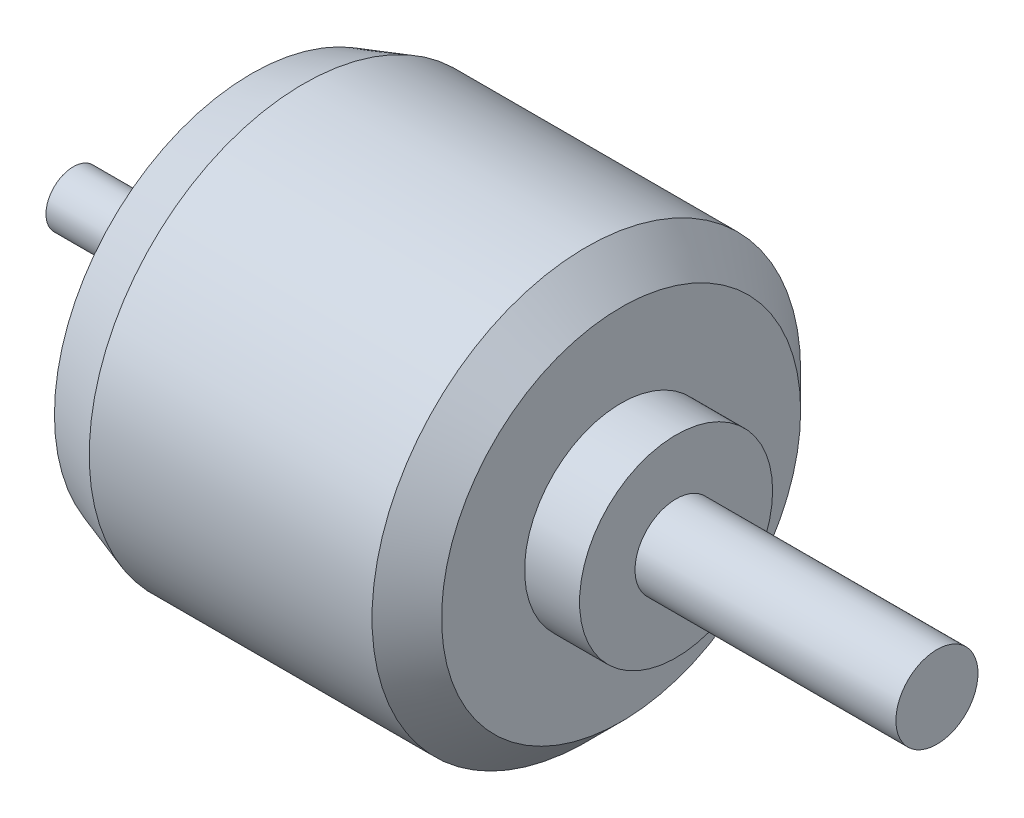
ISO-10303-21;
HEADER;
FILE_DESCRIPTION(('STEP AP214'),'2;1');
FILE_NAME('part.step','',(''),(''),'','','');
FILE_SCHEMA(('AUTOMOTIVE_DESIGN { 1 0 10303 214 1 1 1 1 }'));
ENDSEC;
DATA;
#1=APPLICATION_CONTEXT('core data for automotive mechanical design processes');
#2=APPLICATION_PROTOCOL_DEFINITION('international standard','automotive_design',2000,#1);
#3=PRODUCT_CONTEXT('',#1,'mechanical');
#4=PRODUCT('Part','Part','',(#3));
#5=PRODUCT_RELATED_PRODUCT_CATEGORY('part','',(#4));
#6=PRODUCT_DEFINITION_FORMATION('','',#4);
#7=PRODUCT_DEFINITION_CONTEXT('part definition',#1,'design');
#8=PRODUCT_DEFINITION('design','',#6,#7);
#9=PRODUCT_DEFINITION_SHAPE('','',#8);
#10=(LENGTH_UNIT() NAMED_UNIT(*) SI_UNIT(.MILLI.,.METRE.));
#11=(NAMED_UNIT(*) PLANE_ANGLE_UNIT() SI_UNIT($,.RADIAN.));
#12=(NAMED_UNIT(*) SI_UNIT($,.STERADIAN.) SOLID_ANGLE_UNIT());
#13=UNCERTAINTY_MEASURE_WITH_UNIT(LENGTH_MEASURE(1.E-05),#10,'distance_accuracy_value','');
#14=(GEOMETRIC_REPRESENTATION_CONTEXT(3) GLOBAL_UNCERTAINTY_ASSIGNED_CONTEXT((#13)) GLOBAL_UNIT_ASSIGNED_CONTEXT((#10,
#11,#12)) REPRESENTATION_CONTEXT('',''));
#15=CARTESIAN_POINT('',(0.,0.,0.));
#16=DIRECTION('',(0.,0.,1.));
#17=DIRECTION('',(1.,0.,0.));
#18=AXIS2_PLACEMENT_3D('',#15,#16,#17);
#19=CARTESIAN_POINT('',(26.,0.,0.));
#20=DIRECTION('',(-1.,0.,0.));
#21=DIRECTION('',(0.,0.,1.));
#22=AXIS2_PLACEMENT_3D('',#19,#20,#21);
#23=CYLINDRICAL_SURFACE('',#22,4.);
#24=CARTESIAN_POINT('',(26.,0.,0.));
#25=DIRECTION('',(1.,0.,0.));
#26=DIRECTION('',(0.,0.,-1.));
#27=AXIS2_PLACEMENT_3D('',#24,#25,#26);
#28=CIRCLE('',#27,4.);
#29=CARTESIAN_POINT('',(26.,0.,-4.));
#30=VERTEX_POINT('',#29);
#31=EDGE_CURVE('E111',#30,#30,#28,.T.);
#32=ORIENTED_EDGE('',*,*,#31,.F.);
#33=EDGE_LOOP('',(#32));
#34=FACE_BOUND('',#33,.T.);
#35=CARTESIAN_POINT('',(0.,0.,0.));
#36=DIRECTION('',(1.,0.,0.));
#37=DIRECTION('',(0.,0.,-1.));
#38=AXIS2_PLACEMENT_3D('',#35,#36,#37);
#39=CIRCLE('',#38,4.);
#40=CARTESIAN_POINT('',(0.,0.,-4.));
#41=VERTEX_POINT('',#40);
#42=EDGE_CURVE('E66',#41,#41,#39,.T.);
#43=ORIENTED_EDGE('',*,*,#42,.T.);
#44=EDGE_LOOP('',(#43));
#45=FACE_BOUND('',#44,.T.);
#46=ADVANCED_FACE('F41',(#34,#45),#23,.T.);
#47=CARTESIAN_POINT('',(0.,0.,0.));
#48=DIRECTION('',(1.,0.,0.));
#49=DIRECTION('',(0.,0.,-1.));
#50=AXIS2_PLACEMENT_3D('',#47,#48,#49);
#51=PLANE('',#50);
#52=ORIENTED_EDGE('',*,*,#42,.F.);
#53=EDGE_LOOP('',(#52));
#54=FACE_BOUND('',#53,.T.);
#55=ADVANCED_FACE('F145',(#54),#51,.F.);
#56=CARTESIAN_POINT('',(80.,0.,0.));
#57=DIRECTION('',(-1.,0.,0.));
#58=DIRECTION('',(0.,0.,1.));
#59=AXIS2_PLACEMENT_3D('',#56,#57,#58);
#60=CYLINDRICAL_SURFACE('',#59,31.3);
#61=CARTESIAN_POINT('',(74.9199999999999,0.,0.));
#62=DIRECTION('',(1.,0.,0.));
#63=DIRECTION('',(0.,0.,-1.));
#64=AXIS2_PLACEMENT_3D('',#61,#62,#63);
#65=CIRCLE('',#64,31.3);
#66=CARTESIAN_POINT('',(74.9199999999999,0.,-31.3));
#67=VERTEX_POINT('',#66);
#68=EDGE_CURVE('E46',#67,#67,#65,.F.);
#69=ORIENTED_EDGE('',*,*,#68,.T.);
#70=EDGE_LOOP('',(#69));
#71=FACE_BOUND('',#70,.T.);
#72=CARTESIAN_POINT('',(33.62,0.,0.));
#73=DIRECTION('',(1.,0.,0.));
#74=DIRECTION('',(0.,0.,-1.));
#75=AXIS2_PLACEMENT_3D('',#72,#73,#74);
#76=CIRCLE('',#75,31.3);
#77=CARTESIAN_POINT('',(33.62,0.,-31.3));
#78=VERTEX_POINT('',#77);
#79=EDGE_CURVE('E114',#78,#78,#76,.T.);
#80=ORIENTED_EDGE('',*,*,#79,.T.);
#81=EDGE_LOOP('',(#80));
#82=FACE_BOUND('',#81,.T.);
#83=ADVANCED_FACE('F128',(#71,#82),#60,.T.);
#84=CARTESIAN_POINT('',(80.,0.,0.));
#85=DIRECTION('',(1.,0.,0.));
#86=DIRECTION('',(0.,0.,-1.));
#87=AXIS2_PLACEMENT_3D('',#84,#85,#86);
#88=PLANE('',#87);
#89=CARTESIAN_POINT('',(80.,0.,0.));
#90=DIRECTION('',(1.,0.,0.));
#91=DIRECTION('',(0.,0.,-1.));
#92=AXIS2_PLACEMENT_3D('',#89,#90,#91);
#93=CIRCLE('',#92,14.097);
#94=CARTESIAN_POINT('',(80.,0.,-14.097));
#95=VERTEX_POINT('',#94);
#96=EDGE_CURVE('E50',#95,#95,#93,.T.);
#97=ORIENTED_EDGE('',*,*,#96,.F.);
#98=EDGE_LOOP('',(#97));
#99=FACE_BOUND('',#98,.T.);
#100=CARTESIAN_POINT('',(80.,0.,0.));
#101=DIRECTION('',(1.,0.,0.));
#102=DIRECTION('',(0.,0.,-1.));
#103=AXIS2_PLACEMENT_3D('',#100,#101,#102);
#104=CIRCLE('',#103,26.22);
#105=CARTESIAN_POINT('',(80.,0.,-26.22));
#106=VERTEX_POINT('',#105);
#107=EDGE_CURVE('E121',#106,#106,#104,.T.);
#108=ORIENTED_EDGE('',*,*,#107,.T.);
#109=EDGE_LOOP('',(#108));
#110=FACE_BOUND('',#109,.T.);
#111=ADVANCED_FACE('F163',(#99,#110),#88,.T.);
#112=CARTESIAN_POINT('',(26.,0.,0.));
#113=DIRECTION('',(1.,0.,0.));
#114=DIRECTION('',(0.,0.,-1.));
#115=AXIS2_PLACEMENT_3D('',#112,#113,#114);
#116=PLANE('',#115);
#117=CARTESIAN_POINT('',(26.,0.,0.));
#118=DIRECTION('',(1.,0.,0.));
#119=DIRECTION('',(0.,0.,-1.));
#120=AXIS2_PLACEMENT_3D('',#117,#118,#119);
#121=CIRCLE('',#120,28.76);
#122=CARTESIAN_POINT('',(26.,0.,-28.76));
#123=VERTEX_POINT('',#122);
#124=EDGE_CURVE('E119',#123,#123,#121,.F.);
#125=ORIENTED_EDGE('',*,*,#124,.T.);
#126=EDGE_LOOP('',(#125));
#127=FACE_BOUND('',#126,.T.);
#128=CARTESIAN_POINT('',(26.,22.,0.));
#129=DIRECTION('',(-1.,0.,0.));
#130=DIRECTION('',(0.,0.,1.));
#131=AXIS2_PLACEMENT_3D('',#128,#129,#130);
#132=CIRCLE('',#131,2.);
#133=CARTESIAN_POINT('',(26.,22.,2.));
#134=VERTEX_POINT('',#133);
#135=EDGE_CURVE('E67',#134,#134,#132,.T.);
#136=ORIENTED_EDGE('',*,*,#135,.F.);
#137=EDGE_LOOP('',(#136));
#138=FACE_BOUND('',#137,.T.);
#139=CARTESIAN_POINT('',(26.,0.,-15.));
#140=DIRECTION('',(-1.,0.,0.));
#141=DIRECTION('',(0.,0.,1.));
#142=AXIS2_PLACEMENT_3D('',#139,#140,#141);
#143=CIRCLE('',#142,2.);
#144=CARTESIAN_POINT('',(26.,0.,-13.));
#145=VERTEX_POINT('',#144);
#146=EDGE_CURVE('E84',#145,#145,#143,.T.);
#147=ORIENTED_EDGE('',*,*,#146,.F.);
#148=EDGE_LOOP('',(#147));
#149=FACE_BOUND('',#148,.T.);
#150=CARTESIAN_POINT('',(26.,0.,22.));
#151=DIRECTION('',(-1.,0.,0.));
#152=DIRECTION('',(0.,0.,1.));
#153=AXIS2_PLACEMENT_3D('',#150,#151,#152);
#154=CIRCLE('',#153,2.);
#155=CARTESIAN_POINT('',(26.,0.,24.));
#156=VERTEX_POINT('',#155);
#157=EDGE_CURVE('E78',#156,#156,#154,.T.);
#158=ORIENTED_EDGE('',*,*,#157,.F.);
#159=EDGE_LOOP('',(#158));
#160=FACE_BOUND('',#159,.T.);
#161=CARTESIAN_POINT('',(26.,-15.,-1.57116660247941E-13));
#162=DIRECTION('',(-1.,0.,0.));
#163=DIRECTION('',(0.,0.,1.));
#164=AXIS2_PLACEMENT_3D('',#161,#162,#163);
#165=CIRCLE('',#164,2.);
#166=CARTESIAN_POINT('',(26.,-15.,1.99999999999984));
#167=VERTEX_POINT('',#166);
#168=EDGE_CURVE('E71',#167,#167,#165,.T.);
#169=ORIENTED_EDGE('',*,*,#168,.F.);
#170=EDGE_LOOP('',(#169));
#171=FACE_BOUND('',#170,.T.);
#172=CARTESIAN_POINT('',(26.,0.,15.));
#173=DIRECTION('',(-1.,0.,0.));
#174=DIRECTION('',(0.,0.,1.));
#175=AXIS2_PLACEMENT_3D('',#172,#173,#174);
#176=CIRCLE('',#175,2.);
#177=CARTESIAN_POINT('',(26.,0.,17.));
#178=VERTEX_POINT('',#177);
#179=EDGE_CURVE('E70',#178,#178,#176,.T.);
#180=ORIENTED_EDGE('',*,*,#179,.F.);
#181=EDGE_LOOP('',(#180));
#182=FACE_BOUND('',#181,.T.);
#183=CARTESIAN_POINT('',(26.,-22.,0.));
#184=DIRECTION('',(-1.,0.,0.));
#185=DIRECTION('',(0.,0.,1.));
#186=AXIS2_PLACEMENT_3D('',#183,#184,#185);
#187=CIRCLE('',#186,2.);
#188=CARTESIAN_POINT('',(26.,-22.,2.00000000000001));
#189=VERTEX_POINT('',#188);
#190=EDGE_CURVE('E106',#189,#189,#187,.T.);
#191=ORIENTED_EDGE('',*,*,#190,.F.);
#192=EDGE_LOOP('',(#191));
#193=FACE_BOUND('',#192,.T.);
#194=CARTESIAN_POINT('',(26.,-3.19374361129754E-13,-21.9999999999997));
#195=DIRECTION('',(-1.,0.,0.));
#196=DIRECTION('',(0.,0.,1.));
#197=AXIS2_PLACEMENT_3D('',#194,#195,#196);
#198=CIRCLE('',#197,2.00000000000061);
#199=CARTESIAN_POINT('',(26.,-3.19374361129754E-13,-19.9999999999991));
#200=VERTEX_POINT('',#199);
#201=EDGE_CURVE('E89',#200,#200,#198,.T.);
#202=ORIENTED_EDGE('',*,*,#201,.F.);
#203=EDGE_LOOP('',(#202));
#204=FACE_BOUND('',#203,.T.);
#205=CARTESIAN_POINT('',(26.,15.,0.));
#206=DIRECTION('',(-1.,0.,0.));
#207=DIRECTION('',(0.,0.,1.));
#208=AXIS2_PLACEMENT_3D('',#205,#206,#207);
#209=CIRCLE('',#208,2.);
#210=CARTESIAN_POINT('',(26.,15.,2.00000000000005));
#211=VERTEX_POINT('',#210);
#212=EDGE_CURVE('E96',#211,#211,#209,.T.);
#213=ORIENTED_EDGE('',*,*,#212,.F.);
#214=EDGE_LOOP('',(#213));
#215=FACE_BOUND('',#214,.T.);
#216=ORIENTED_EDGE('',*,*,#31,.T.);
#217=EDGE_LOOP('',(#216));
#218=FACE_BOUND('',#217,.T.);
#219=ADVANCED_FACE('F164',(#127,#138,#149,#160,#171,#182,#193,#204,#215,#218),#116,.F.);
#220=CARTESIAN_POINT('',(34.,15.,0.));
#221=DIRECTION('',(-1.,0.,0.));
#222=DIRECTION('',(0.,0.,1.));
#223=AXIS2_PLACEMENT_3D('',#220,#221,#222);
#224=CYLINDRICAL_SURFACE('',#223,2.);
#225=CARTESIAN_POINT('',(34.,15.,0.));
#226=DIRECTION('',(-1.,0.,0.));
#227=DIRECTION('',(0.,0.,1.));
#228=AXIS2_PLACEMENT_3D('',#225,#226,#227);
#229=CIRCLE('',#228,2.);
#230=CARTESIAN_POINT('',(34.,15.,2.00000000000005));
#231=VERTEX_POINT('',#230);
#232=EDGE_CURVE('E74',#231,#231,#229,.T.);
#233=ORIENTED_EDGE('',*,*,#232,.F.);
#234=EDGE_LOOP('',(#233));
#235=FACE_BOUND('',#234,.T.);
#236=ORIENTED_EDGE('',*,*,#212,.T.);
#237=EDGE_LOOP('',(#236));
#238=FACE_BOUND('',#237,.T.);
#239=ADVANCED_FACE('F167',(#235,#238),#224,.F.);
#240=CARTESIAN_POINT('',(34.,0.,0.));
#241=DIRECTION('',(-1.,0.,0.));
#242=DIRECTION('',(0.,0.,1.));
#243=AXIS2_PLACEMENT_3D('',#240,#241,#242);
#244=PLANE('',#243);
#245=ORIENTED_EDGE('',*,*,#232,.T.);
#246=EDGE_LOOP('',(#245));
#247=FACE_BOUND('',#246,.T.);
#248=ADVANCED_FACE('F190',(#247),#244,.T.);
#249=CARTESIAN_POINT('',(34.,-3.19374361129754E-13,-21.9999999999997));
#250=DIRECTION('',(-1.,0.,0.));
#251=DIRECTION('',(0.,0.,1.));
#252=AXIS2_PLACEMENT_3D('',#249,#250,#251);
#253=CYLINDRICAL_SURFACE('',#252,2.00000000000061);
#254=CARTESIAN_POINT('',(34.,-3.19374361129754E-13,-21.9999999999997));
#255=DIRECTION('',(-1.,0.,0.));
#256=DIRECTION('',(0.,0.,1.));
#257=AXIS2_PLACEMENT_3D('',#254,#255,#256);
#258=CIRCLE('',#257,2.00000000000061);
#259=CARTESIAN_POINT('',(34.,-3.19374361129754E-13,-19.9999999999991));
#260=VERTEX_POINT('',#259);
#261=EDGE_CURVE('E93',#260,#260,#258,.T.);
#262=ORIENTED_EDGE('',*,*,#261,.F.);
#263=EDGE_LOOP('',(#262));
#264=FACE_BOUND('',#263,.T.);
#265=ORIENTED_EDGE('',*,*,#201,.T.);
#266=EDGE_LOOP('',(#265));
#267=FACE_BOUND('',#266,.T.);
#268=ADVANCED_FACE('F193',(#264,#267),#253,.F.);
#269=CARTESIAN_POINT('',(34.,0.,0.));
#270=DIRECTION('',(-1.,0.,0.));
#271=DIRECTION('',(0.,0.,1.));
#272=AXIS2_PLACEMENT_3D('',#269,#270,#271);
#273=PLANE('',#272);
#274=ORIENTED_EDGE('',*,*,#261,.T.);
#275=EDGE_LOOP('',(#274));
#276=FACE_BOUND('',#275,.T.);
#277=ADVANCED_FACE('F180',(#276),#273,.T.);
#278=CARTESIAN_POINT('',(34.,-22.,0.));
#279=DIRECTION('',(-1.,0.,0.));
#280=DIRECTION('',(0.,0.,1.));
#281=AXIS2_PLACEMENT_3D('',#278,#279,#280);
#282=CYLINDRICAL_SURFACE('',#281,2.);
#283=CARTESIAN_POINT('',(34.,-22.,0.));
#284=DIRECTION('',(-1.,0.,0.));
#285=DIRECTION('',(0.,0.,1.));
#286=AXIS2_PLACEMENT_3D('',#283,#284,#285);
#287=CIRCLE('',#286,2.);
#288=CARTESIAN_POINT('',(34.,-22.,2.00000000000001));
#289=VERTEX_POINT('',#288);
#290=EDGE_CURVE('E92',#289,#289,#287,.T.);
#291=ORIENTED_EDGE('',*,*,#290,.F.);
#292=EDGE_LOOP('',(#291));
#293=FACE_BOUND('',#292,.T.);
#294=ORIENTED_EDGE('',*,*,#190,.T.);
#295=EDGE_LOOP('',(#294));
#296=FACE_BOUND('',#295,.T.);
#297=ADVANCED_FACE('F176',(#293,#296),#282,.F.);
#298=CARTESIAN_POINT('',(34.,0.,0.));
#299=DIRECTION('',(-1.,0.,0.));
#300=DIRECTION('',(0.,0.,1.));
#301=AXIS2_PLACEMENT_3D('',#298,#299,#300);
#302=PLANE('',#301);
#303=ORIENTED_EDGE('',*,*,#290,.T.);
#304=EDGE_LOOP('',(#303));
#305=FACE_BOUND('',#304,.T.);
#306=ADVANCED_FACE('F172',(#305),#302,.T.);
#307=CARTESIAN_POINT('',(34.,0.,15.));
#308=DIRECTION('',(-1.,0.,0.));
#309=DIRECTION('',(0.,0.,1.));
#310=AXIS2_PLACEMENT_3D('',#307,#308,#309);
#311=CYLINDRICAL_SURFACE('',#310,2.);
#312=CARTESIAN_POINT('',(34.,0.,15.));
#313=DIRECTION('',(-1.,0.,0.));
#314=DIRECTION('',(0.,0.,1.));
#315=AXIS2_PLACEMENT_3D('',#312,#313,#314);
#316=CIRCLE('',#315,2.);
#317=CARTESIAN_POINT('',(34.,0.,17.));
#318=VERTEX_POINT('',#317);
#319=EDGE_CURVE('E103',#318,#318,#316,.T.);
#320=ORIENTED_EDGE('',*,*,#319,.F.);
#321=EDGE_LOOP('',(#320));
#322=FACE_BOUND('',#321,.T.);
#323=ORIENTED_EDGE('',*,*,#179,.T.);
#324=EDGE_LOOP('',(#323));
#325=FACE_BOUND('',#324,.T.);
#326=ADVANCED_FACE('F175',(#322,#325),#311,.F.);
#327=CARTESIAN_POINT('',(34.,0.,0.));
#328=DIRECTION('',(-1.,0.,0.));
#329=DIRECTION('',(0.,0.,1.));
#330=AXIS2_PLACEMENT_3D('',#327,#328,#329);
#331=PLANE('',#330);
#332=ORIENTED_EDGE('',*,*,#319,.T.);
#333=EDGE_LOOP('',(#332));
#334=FACE_BOUND('',#333,.T.);
#335=ADVANCED_FACE('F182',(#334),#331,.T.);
#336=CARTESIAN_POINT('',(34.,-15.,-1.57116660247941E-13));
#337=DIRECTION('',(-1.,0.,0.));
#338=DIRECTION('',(0.,0.,1.));
#339=AXIS2_PLACEMENT_3D('',#336,#337,#338);
#340=CYLINDRICAL_SURFACE('',#339,2.);
#341=CARTESIAN_POINT('',(34.,-15.,-1.57116660247941E-13));
#342=DIRECTION('',(-1.,0.,0.));
#343=DIRECTION('',(0.,0.,1.));
#344=AXIS2_PLACEMENT_3D('',#341,#342,#343);
#345=CIRCLE('',#344,2.);
#346=CARTESIAN_POINT('',(34.,-15.,1.99999999999984));
#347=VERTEX_POINT('',#346);
#348=EDGE_CURVE('E75',#347,#347,#345,.T.);
#349=ORIENTED_EDGE('',*,*,#348,.F.);
#350=EDGE_LOOP('',(#349));
#351=FACE_BOUND('',#350,.T.);
#352=ORIENTED_EDGE('',*,*,#168,.T.);
#353=EDGE_LOOP('',(#352));
#354=FACE_BOUND('',#353,.T.);
#355=ADVANCED_FACE('F185',(#351,#354),#340,.F.);
#356=CARTESIAN_POINT('',(34.,0.,0.));
#357=DIRECTION('',(-1.,0.,0.));
#358=DIRECTION('',(0.,0.,1.));
#359=AXIS2_PLACEMENT_3D('',#356,#357,#358);
#360=PLANE('',#359);
#361=ORIENTED_EDGE('',*,*,#348,.T.);
#362=EDGE_LOOP('',(#361));
#363=FACE_BOUND('',#362,.T.);
#364=ADVANCED_FACE('F220',(#363),#360,.T.);
#365=CARTESIAN_POINT('',(34.,0.,22.));
#366=DIRECTION('',(-1.,0.,0.));
#367=DIRECTION('',(0.,0.,1.));
#368=AXIS2_PLACEMENT_3D('',#365,#366,#367);
#369=CYLINDRICAL_SURFACE('',#368,2.);
#370=CARTESIAN_POINT('',(34.,0.,22.));
#371=DIRECTION('',(-1.,0.,0.));
#372=DIRECTION('',(0.,0.,1.));
#373=AXIS2_PLACEMENT_3D('',#370,#371,#372);
#374=CIRCLE('',#373,2.);
#375=CARTESIAN_POINT('',(34.,0.,24.));
#376=VERTEX_POINT('',#375);
#377=EDGE_CURVE('E81',#376,#376,#374,.T.);
#378=ORIENTED_EDGE('',*,*,#377,.F.);
#379=EDGE_LOOP('',(#378));
#380=FACE_BOUND('',#379,.T.);
#381=ORIENTED_EDGE('',*,*,#157,.T.);
#382=EDGE_LOOP('',(#381));
#383=FACE_BOUND('',#382,.T.);
#384=ADVANCED_FACE('F216',(#380,#383),#369,.F.);
#385=CARTESIAN_POINT('',(34.,0.,0.));
#386=DIRECTION('',(-1.,0.,0.));
#387=DIRECTION('',(0.,0.,1.));
#388=AXIS2_PLACEMENT_3D('',#385,#386,#387);
#389=PLANE('',#388);
#390=ORIENTED_EDGE('',*,*,#377,.T.);
#391=EDGE_LOOP('',(#390));
#392=FACE_BOUND('',#391,.T.);
#393=ADVANCED_FACE('F212',(#392),#389,.T.);
#394=CARTESIAN_POINT('',(34.,0.,-15.));
#395=DIRECTION('',(-1.,0.,0.));
#396=DIRECTION('',(0.,0.,1.));
#397=AXIS2_PLACEMENT_3D('',#394,#395,#396);
#398=CYLINDRICAL_SURFACE('',#397,2.);
#399=CARTESIAN_POINT('',(34.,0.,-15.));
#400=DIRECTION('',(-1.,0.,0.));
#401=DIRECTION('',(0.,0.,1.));
#402=AXIS2_PLACEMENT_3D('',#399,#400,#401);
#403=CIRCLE('',#402,2.);
#404=CARTESIAN_POINT('',(34.,0.,-13.));
#405=VERTEX_POINT('',#404);
#406=EDGE_CURVE('E61',#405,#405,#403,.T.);
#407=ORIENTED_EDGE('',*,*,#406,.F.);
#408=EDGE_LOOP('',(#407));
#409=FACE_BOUND('',#408,.T.);
#410=ORIENTED_EDGE('',*,*,#146,.T.);
#411=EDGE_LOOP('',(#410));
#412=FACE_BOUND('',#411,.T.);
#413=ADVANCED_FACE('F208',(#409,#412),#398,.F.);
#414=CARTESIAN_POINT('',(34.,0.,-15.));
#415=DIRECTION('',(-1.,0.,0.));
#416=DIRECTION('',(0.,0.,1.));
#417=AXIS2_PLACEMENT_3D('',#414,#415,#416);
#418=PLANE('',#417);
#419=ORIENTED_EDGE('',*,*,#406,.T.);
#420=EDGE_LOOP('',(#419));
#421=FACE_BOUND('',#420,.T.);
#422=ADVANCED_FACE('F204',(#421),#418,.T.);
#423=CARTESIAN_POINT('',(34.,22.,0.));
#424=DIRECTION('',(-1.,0.,0.));
#425=DIRECTION('',(0.,0.,1.));
#426=AXIS2_PLACEMENT_3D('',#423,#424,#425);
#427=CYLINDRICAL_SURFACE('',#426,2.);
#428=CARTESIAN_POINT('',(34.,22.,0.));
#429=DIRECTION('',(-1.,0.,0.));
#430=DIRECTION('',(0.,0.,1.));
#431=AXIS2_PLACEMENT_3D('',#428,#429,#430);
#432=CIRCLE('',#431,2.);
#433=CARTESIAN_POINT('',(34.,22.,2.));
#434=VERTEX_POINT('',#433);
#435=EDGE_CURVE('E63',#434,#434,#432,.T.);
#436=ORIENTED_EDGE('',*,*,#435,.F.);
#437=EDGE_LOOP('',(#436));
#438=FACE_BOUND('',#437,.T.);
#439=ORIENTED_EDGE('',*,*,#135,.T.);
#440=EDGE_LOOP('',(#439));
#441=FACE_BOUND('',#440,.T.);
#442=ADVANCED_FACE('F207',(#438,#441),#427,.F.);
#443=CARTESIAN_POINT('',(34.,0.,0.));
#444=DIRECTION('',(-1.,0.,0.));
#445=DIRECTION('',(0.,0.,1.));
#446=AXIS2_PLACEMENT_3D('',#443,#444,#445);
#447=PLANE('',#446);
#448=ORIENTED_EDGE('',*,*,#435,.T.);
#449=EDGE_LOOP('',(#448));
#450=FACE_BOUND('',#449,.T.);
#451=ADVANCED_FACE('F142',(#450),#447,.T.);
#452=CARTESIAN_POINT('',(33.62,0.,0.));
#453=DIRECTION('',(1.,0.,0.));
#454=DIRECTION('',(0.,0.,-1.));
#455=AXIS2_PLACEMENT_3D('',#452,#453,#454);
#456=CONICAL_SURFACE('',#455,31.3,0.321750554396639);
#457=ORIENTED_EDGE('',*,*,#124,.F.);
#458=EDGE_LOOP('',(#457));
#459=FACE_BOUND('',#458,.T.);
#460=ORIENTED_EDGE('',*,*,#79,.F.);
#461=EDGE_LOOP('',(#460));
#462=FACE_BOUND('',#461,.T.);
#463=ADVANCED_FACE('F134',(#459,#462),#456,.T.);
#464=CARTESIAN_POINT('',(80.,0.,0.));
#465=DIRECTION('',(-1.,0.,0.));
#466=DIRECTION('',(0.,0.,1.));
#467=AXIS2_PLACEMENT_3D('',#464,#465,#466);
#468=CONICAL_SURFACE('',#467,26.22,0.785398163397448);
#469=ORIENTED_EDGE('',*,*,#68,.F.);
#470=EDGE_LOOP('',(#469));
#471=FACE_BOUND('',#470,.T.);
#472=ORIENTED_EDGE('',*,*,#107,.F.);
#473=EDGE_LOOP('',(#472));
#474=FACE_BOUND('',#473,.T.);
#475=ADVANCED_FACE('F44',(#471,#474),#468,.T.);
#476=CARTESIAN_POINT('',(88.0264,0.,0.));
#477=DIRECTION('',(-1.,0.,0.));
#478=DIRECTION('',(0.,0.,1.));
#479=AXIS2_PLACEMENT_3D('',#476,#477,#478);
#480=CYLINDRICAL_SURFACE('',#479,14.097);
#481=CARTESIAN_POINT('',(88.0264,0.,0.));
#482=DIRECTION('',(1.,0.,0.));
#483=DIRECTION('',(0.,0.,-1.));
#484=AXIS2_PLACEMENT_3D('',#481,#482,#483);
#485=CIRCLE('',#484,14.097);
#486=CARTESIAN_POINT('',(88.0264,0.,-14.097));
#487=VERTEX_POINT('',#486);
#488=EDGE_CURVE('E59',#487,#487,#485,.T.);
#489=ORIENTED_EDGE('',*,*,#488,.F.);
#490=EDGE_LOOP('',(#489));
#491=FACE_BOUND('',#490,.T.);
#492=ORIENTED_EDGE('',*,*,#96,.T.);
#493=EDGE_LOOP('',(#492));
#494=FACE_BOUND('',#493,.T.);
#495=ADVANCED_FACE('F133',(#491,#494),#480,.T.);
#496=CARTESIAN_POINT('',(88.0264,0.,0.));
#497=DIRECTION('',(1.,0.,0.));
#498=DIRECTION('',(0.,0.,-1.));
#499=AXIS2_PLACEMENT_3D('',#496,#497,#498);
#500=PLANE('',#499);
#501=CARTESIAN_POINT('',(88.0264,0.,0.));
#502=DIRECTION('',(1.,0.,0.));
#503=DIRECTION('',(0.,0.,-1.));
#504=AXIS2_PLACEMENT_3D('',#501,#502,#503);
#505=CIRCLE('',#504,5.9944);
#506=CARTESIAN_POINT('',(88.0264,0.,-5.9944));
#507=VERTEX_POINT('',#506);
#508=EDGE_CURVE('E10',#507,#507,#505,.T.);
#509=ORIENTED_EDGE('',*,*,#508,.F.);
#510=EDGE_LOOP('',(#509));
#511=FACE_BOUND('',#510,.T.);
#512=ORIENTED_EDGE('',*,*,#488,.T.);
#513=EDGE_LOOP('',(#512));
#514=FACE_BOUND('',#513,.T.);
#515=ADVANCED_FACE('F139',(#511,#514),#500,.T.);
#516=CARTESIAN_POINT('',(126.1264,0.,0.));
#517=DIRECTION('',(-1.,0.,0.));
#518=DIRECTION('',(0.,0.,1.));
#519=AXIS2_PLACEMENT_3D('',#516,#517,#518);
#520=CYLINDRICAL_SURFACE('',#519,5.9944);
#521=CARTESIAN_POINT('',(126.1264,0.,0.));
#522=DIRECTION('',(1.,0.,0.));
#523=DIRECTION('',(0.,0.,-1.));
#524=AXIS2_PLACEMENT_3D('',#521,#522,#523);
#525=CIRCLE('',#524,5.9944);
#526=CARTESIAN_POINT('',(126.1264,0.,-5.9944));
#527=VERTEX_POINT('',#526);
#528=EDGE_CURVE('E58',#527,#527,#525,.T.);
#529=ORIENTED_EDGE('',*,*,#528,.F.);
#530=EDGE_LOOP('',(#529));
#531=FACE_BOUND('',#530,.T.);
#532=ORIENTED_EDGE('',*,*,#508,.T.);
#533=EDGE_LOOP('',(#532));
#534=FACE_BOUND('',#533,.T.);
#535=ADVANCED_FACE('F236',(#531,#534),#520,.T.);
#536=CARTESIAN_POINT('',(126.1264,0.,0.));
#537=DIRECTION('',(1.,0.,0.));
#538=DIRECTION('',(0.,0.,-1.));
#539=AXIS2_PLACEMENT_3D('',#536,#537,#538);
#540=PLANE('',#539);
#541=ORIENTED_EDGE('',*,*,#528,.T.);
#542=EDGE_LOOP('',(#541));
#543=FACE_BOUND('',#542,.T.);
#544=ADVANCED_FACE('F240',(#543),#540,.T.);
#545=CLOSED_SHELL('',(#46,#55,#83,#111,#219,#239,#248,#268,#277,#297,#306,#326,#335,#355,#364,
#384,#393,#413,#422,#442,#451,#463,#475,#495,#515,#535,#544));
#546=MANIFOLD_SOLID_BREP('B2',#545);
#547=ADVANCED_BREP_SHAPE_REPRESENTATION('',(#18,#546),#14);
#548=SHAPE_DEFINITION_REPRESENTATION(#9,#547);
ENDSEC;
END-ISO-10303-21;
